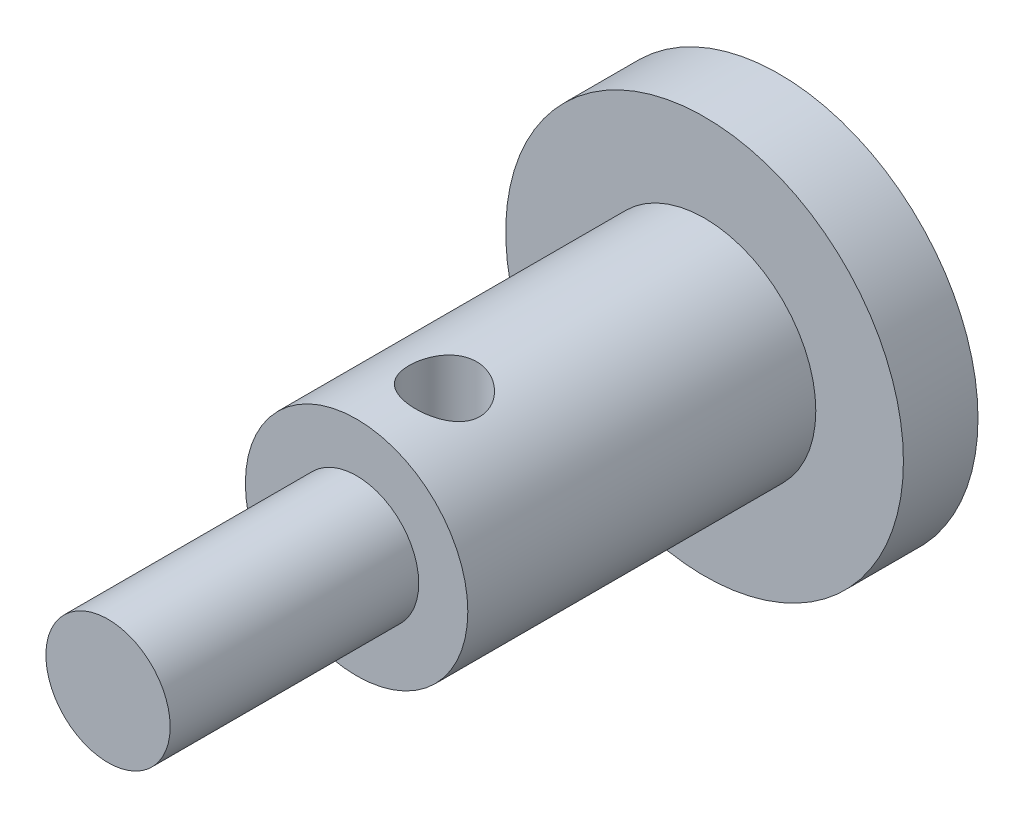
ISO-10303-21;
HEADER;
FILE_DESCRIPTION(('STEP AP214'),'2;1');
FILE_NAME('part.step','',(''),(''),'','','');
FILE_SCHEMA(('AUTOMOTIVE_DESIGN { 1 0 10303 214 1 1 1 1 }'));
ENDSEC;
DATA;
#1=APPLICATION_CONTEXT('core data for automotive mechanical design processes');
#2=APPLICATION_PROTOCOL_DEFINITION('international standard','automotive_design',2000,#1);
#3=PRODUCT_CONTEXT('',#1,'mechanical');
#4=PRODUCT('Part','Part','',(#3));
#5=PRODUCT_RELATED_PRODUCT_CATEGORY('part','',(#4));
#6=PRODUCT_DEFINITION_FORMATION('','',#4);
#7=PRODUCT_DEFINITION_CONTEXT('part definition',#1,'design');
#8=PRODUCT_DEFINITION('design','',#6,#7);
#9=PRODUCT_DEFINITION_SHAPE('','',#8);
#10=(LENGTH_UNIT() NAMED_UNIT(*) SI_UNIT(.MILLI.,.METRE.));
#11=(NAMED_UNIT(*) PLANE_ANGLE_UNIT() SI_UNIT($,.RADIAN.));
#12=(NAMED_UNIT(*) SI_UNIT($,.STERADIAN.) SOLID_ANGLE_UNIT());
#13=UNCERTAINTY_MEASURE_WITH_UNIT(LENGTH_MEASURE(1.E-05),#10,'distance_accuracy_value','');
#14=(GEOMETRIC_REPRESENTATION_CONTEXT(3) GLOBAL_UNCERTAINTY_ASSIGNED_CONTEXT((#13)) GLOBAL_UNIT_ASSIGNED_CONTEXT((#10,
#11,#12)) REPRESENTATION_CONTEXT('',''));
#15=CARTESIAN_POINT('',(0.,0.,0.));
#16=DIRECTION('',(0.,0.,1.));
#17=DIRECTION('',(1.,0.,0.));
#18=AXIS2_PLACEMENT_3D('',#15,#16,#17);
#19=CARTESIAN_POINT('',(0.,0.,17.));
#20=DIRECTION('',(0.,0.,1.));
#21=DIRECTION('',(1.,0.,0.));
#22=AXIS2_PLACEMENT_3D('',#19,#20,#21);
#23=PLANE('',#22);
#24=CARTESIAN_POINT('',(0.,0.,17.));
#25=DIRECTION('',(0.,0.,1.));
#26=DIRECTION('',(1.,0.,0.));
#27=AXIS2_PLACEMENT_3D('',#24,#25,#26);
#28=CIRCLE('',#27,4.475);
#29=CARTESIAN_POINT('',(4.475,0.,17.));
#30=VERTEX_POINT('',#29);
#31=EDGE_CURVE('E47',#30,#30,#28,.T.);
#32=ORIENTED_EDGE('',*,*,#31,.T.);
#33=EDGE_LOOP('',(#32));
#34=FACE_BOUND('',#33,.T.);
#35=CARTESIAN_POINT('',(0.,0.,17.));
#36=DIRECTION('',(0.,0.,1.));
#37=DIRECTION('',(1.,0.,0.));
#38=AXIS2_PLACEMENT_3D('',#35,#36,#37);
#39=CIRCLE('',#38,2.5);
#40=CARTESIAN_POINT('',(2.5,0.,17.));
#41=VERTEX_POINT('',#40);
#42=EDGE_CURVE('E84',#41,#41,#39,.T.);
#43=ORIENTED_EDGE('',*,*,#42,.F.);
#44=EDGE_LOOP('',(#43));
#45=FACE_BOUND('',#44,.T.);
#46=ADVANCED_FACE('F30',(#34,#45),#23,.T.);
#47=CARTESIAN_POINT('',(0.,0.,3.));
#48=DIRECTION('',(0.,0.,1.));
#49=DIRECTION('',(1.,0.,0.));
#50=AXIS2_PLACEMENT_3D('',#47,#48,#49);
#51=PLANE('',#50);
#52=CARTESIAN_POINT('',(0.,0.,3.));
#53=DIRECTION('',(0.,0.,1.));
#54=DIRECTION('',(1.,0.,0.));
#55=AXIS2_PLACEMENT_3D('',#52,#53,#54);
#56=CIRCLE('',#55,8.);
#57=CARTESIAN_POINT('',(8.,0.,3.));
#58=VERTEX_POINT('',#57);
#59=EDGE_CURVE('E10',#58,#58,#56,.T.);
#60=ORIENTED_EDGE('',*,*,#59,.T.);
#61=EDGE_LOOP('',(#60));
#62=FACE_BOUND('',#61,.T.);
#63=CARTESIAN_POINT('',(0.,0.,3.));
#64=DIRECTION('',(0.,0.,1.));
#65=DIRECTION('',(1.,0.,0.));
#66=AXIS2_PLACEMENT_3D('',#63,#64,#65);
#67=CIRCLE('',#66,4.475);
#68=CARTESIAN_POINT('',(4.475,0.,3.));
#69=VERTEX_POINT('',#68);
#70=EDGE_CURVE('E50',#69,#69,#67,.T.);
#71=ORIENTED_EDGE('',*,*,#70,.F.);
#72=EDGE_LOOP('',(#71));
#73=FACE_BOUND('',#72,.T.);
#74=ADVANCED_FACE('F74',(#62,#73),#51,.T.);
#75=CARTESIAN_POINT('',(0.,0.,3.));
#76=DIRECTION('',(0.,0.,-1.));
#77=DIRECTION('',(-1.,0.,0.));
#78=AXIS2_PLACEMENT_3D('',#75,#76,#77);
#79=CYLINDRICAL_SURFACE('',#78,8.);
#80=ORIENTED_EDGE('',*,*,#59,.F.);
#81=EDGE_LOOP('',(#80));
#82=FACE_BOUND('',#81,.T.);
#83=CARTESIAN_POINT('',(0.,0.,0.));
#84=DIRECTION('',(0.,0.,1.));
#85=DIRECTION('',(1.,0.,0.));
#86=AXIS2_PLACEMENT_3D('',#83,#84,#85);
#87=CIRCLE('',#86,8.);
#88=CARTESIAN_POINT('',(8.,0.,0.));
#89=VERTEX_POINT('',#88);
#90=EDGE_CURVE('E42',#89,#89,#87,.T.);
#91=ORIENTED_EDGE('',*,*,#90,.T.);
#92=EDGE_LOOP('',(#91));
#93=FACE_BOUND('',#92,.T.);
#94=ADVANCED_FACE('F32',(#82,#93),#79,.T.);
#95=CARTESIAN_POINT('',(0.,0.,0.));
#96=DIRECTION('',(0.,0.,1.));
#97=DIRECTION('',(1.,0.,0.));
#98=AXIS2_PLACEMENT_3D('',#95,#96,#97);
#99=PLANE('',#98);
#100=ORIENTED_EDGE('',*,*,#90,.F.);
#101=EDGE_LOOP('',(#100));
#102=FACE_BOUND('',#101,.T.);
#103=ADVANCED_FACE('F96',(#102),#99,.F.);
#104=CARTESIAN_POINT('',(0.,0.,17.));
#105=DIRECTION('',(0.,0.,-1.));
#106=DIRECTION('',(-1.,0.,0.));
#107=AXIS2_PLACEMENT_3D('',#104,#105,#106);
#108=CYLINDRICAL_SURFACE('',#107,4.475);
#109=CARTESIAN_POINT('',(0.525,-4.44409720865779,15.4151527868712));
#110=CARTESIAN_POINT('',(0.605012065182564,-4.43464369556174,15.4151512445683));
#111=CARTESIAN_POINT('',(0.684780562824033,-4.42300882738794,15.4083905448992));
#112=CARTESIAN_POINT('',(0.841456441181997,-4.3958970357306,15.3818435556699));
#113=CARTESIAN_POINT('',(0.918362178822913,-4.38041794379825,15.362049904044));
#114=CARTESIAN_POINT('',(1.06706900065759,-4.34658400698397,15.3103679521133));
#115=CARTESIAN_POINT('',(1.13888261209456,-4.32823660248138,15.2785106489329));
#116=CARTESIAN_POINT('',(1.27597831846422,-4.28982273173913,15.2037251079734));
#117=CARTESIAN_POINT('',(1.34125941804507,-4.26975600439011,15.1607951866255));
#118=CARTESIAN_POINT('',(1.46659270250455,-4.22838936108524,15.0628265855569));
#119=CARTESIAN_POINT('',(1.52628942871232,-4.2070739857202,15.0073389910547));
#120=CARTESIAN_POINT('',(1.63559780198055,-4.16579703592693,14.8867148224825));
#121=CARTESIAN_POINT('',(1.68520695969933,-4.14583579647105,14.8215758735558));
#122=CARTESIAN_POINT('',(1.77330661965326,-4.10893156378564,14.6823972932089));
#123=CARTESIAN_POINT('',(1.81168184822287,-4.09202050260056,14.6082757175539));
#124=CARTESIAN_POINT('',(1.87510942559609,-4.06335012686617,14.4536174850738));
#125=CARTESIAN_POINT('',(1.90017229890545,-4.05158674395603,14.3730859539383));
#126=CARTESIAN_POINT('',(1.93434949375536,-4.03537465048781,14.2146583434211));
#127=CARTESIAN_POINT('',(1.94455986570693,-4.03042489483808,14.1370504157553));
#128=CARTESIAN_POINT('',(1.95210568539031,-4.02677670241697,13.9810784002129));
#129=CARTESIAN_POINT('',(1.94944676893413,-4.02807552921959,13.9027146583306));
#130=CARTESIAN_POINT('',(1.93205315913773,-4.03644307005809,13.7533416519209));
#131=CARTESIAN_POINT('',(1.91818766880572,-4.04309633051778,13.6822047734311));
#132=CARTESIAN_POINT('',(1.8800662687396,-4.06096234609981,13.5433821139513));
#133=CARTESIAN_POINT('',(1.85580852753211,-4.07217590488648,13.4756969436254));
#134=CARTESIAN_POINT('',(1.79677877846324,-4.09857110642983,13.3431246010191));
#135=CARTESIAN_POINT('',(1.76168249083852,-4.11387283323108,13.2784065239222));
#136=CARTESIAN_POINT('',(1.68233433719151,-4.1469532808019,13.1555538648981));
#137=CARTESIAN_POINT('',(1.63807886603702,-4.16473297601815,13.0974218893003));
#138=CARTESIAN_POINT('',(1.53703367223395,-4.20313302816671,12.9838206898946));
#139=CARTESIAN_POINT('',(1.47946931963451,-4.22386460793297,12.9290766259361));
#140=CARTESIAN_POINT('',(1.35600367204305,-4.26510428781182,12.8298360969334));
#141=CARTESIAN_POINT('',(1.29009959497533,-4.28561231085627,12.7853430656));
#142=CARTESIAN_POINT('',(1.14841607934971,-4.32578421740276,12.7060801193193));
#143=CARTESIAN_POINT('',(1.07233377844367,-4.34537383493074,12.6718108186845));
#144=CARTESIAN_POINT('',(0.91466246132093,-4.38127190957764,12.6169268011243));
#145=CARTESIAN_POINT('',(0.8330751347605,-4.39758136741227,12.5963079152983));
#146=CARTESIAN_POINT('',(0.670142351244457,-4.4252780694317,12.5702625262009));
#147=CARTESIAN_POINT('',(0.588918715901119,-4.43683665619245,12.5642592609818));
#148=CARTESIAN_POINT('',(0.426131674204313,-4.45541686644188,12.5662606139193));
#149=CARTESIAN_POINT('',(0.344568399377873,-4.46244010675176,12.5742602363606));
#150=CARTESIAN_POINT('',(0.188163186510881,-4.47169191923213,12.6033764791664));
#151=CARTESIAN_POINT('',(0.113197008558179,-4.47416058517768,12.6237556940672));
#152=CARTESIAN_POINT('',(-0.0324528816684802,-4.47547518325439,12.6764299098869));
#153=CARTESIAN_POINT('',(-0.103136656087699,-4.47432116796992,12.7087247378409));
#154=CARTESIAN_POINT('',(-0.237946438962588,-4.46917715997548,12.7841347734468));
#155=CARTESIAN_POINT('',(-0.302099189312989,-4.46519931179385,12.8272031351925));
#156=CARTESIAN_POINT('',(-0.422536586260892,-4.4554174267679,12.92304237999));
#157=CARTESIAN_POINT('',(-0.478819872719763,-4.44961307479733,12.9758149366506));
#158=CARTESIAN_POINT('',(-0.583719501476302,-4.43709120913845,13.0914608347357));
#159=CARTESIAN_POINT('',(-0.632043979966886,-4.43035096044559,13.1545966474472));
#160=CARTESIAN_POINT('',(-0.717561548233948,-4.4173077649887,13.2880505412357));
#161=CARTESIAN_POINT('',(-0.75475378375657,-4.41100485181293,13.3583691729449));
#162=CARTESIAN_POINT('',(-0.817391637650078,-4.39983274351559,13.5053100136301));
#163=CARTESIAN_POINT('',(-0.842671449145731,-4.39498410880699,13.5820046604291));
#164=CARTESIAN_POINT('',(-0.879940943503478,-4.38767531552168,13.7386642552317));
#165=CARTESIAN_POINT('',(-0.891932563629168,-4.38521480879022,13.8186287247702));
#166=CARTESIAN_POINT('',(-0.902148989132983,-4.38312433775067,13.978095815519));
#167=CARTESIAN_POINT('',(-0.900605219970952,-4.38344678946501,14.0575830336042));
#168=CARTESIAN_POINT('',(-0.884353673174332,-4.38675399341761,14.2151401767178));
#169=CARTESIAN_POINT('',(-0.869646072091619,-4.38973870994987,14.2932101207402));
#170=CARTESIAN_POINT('',(-0.827677104884753,-4.39784310345277,14.4451954680354));
#171=CARTESIAN_POINT('',(-0.800502305497801,-4.40294803579624,14.5191356384506));
#172=CARTESIAN_POINT('',(-0.734414486889016,-4.41445126583187,14.6614637230281));
#173=CARTESIAN_POINT('',(-0.695499895310412,-4.42084973673487,14.7298508918968));
#174=CARTESIAN_POINT('',(-0.606170163860191,-4.43398823480564,14.8604701958604));
#175=CARTESIAN_POINT('',(-0.555558712882236,-4.44073235769492,14.922567750032));
#176=CARTESIAN_POINT('',(-0.444591724881872,-4.45320935007348,15.0374810349549));
#177=CARTESIAN_POINT('',(-0.384235338369446,-4.45894213131037,15.0902959556771));
#178=CARTESIAN_POINT('',(-0.255171030487521,-4.46818839904842,15.1853105132368));
#179=CARTESIAN_POINT('',(-0.186433572750902,-4.47169374951065,15.227470898966));
#180=CARTESIAN_POINT('',(-0.0427820018485037,-4.47537058711884,15.2996184349974));
#181=CARTESIAN_POINT('',(0.0321286097148479,-4.47554395137414,15.3296124300391));
#182=CARTESIAN_POINT('',(0.176446301706826,-4.47203016182671,15.3736691539589));
#183=CARTESIAN_POINT('',(0.245412259707018,-4.46881068785192,15.3892274347096));
#184=CARTESIAN_POINT('',(0.384647781324508,-4.45898435598281,15.4099698416118));
#185=CARTESIAN_POINT('',(0.45491732355909,-4.45237755360364,15.4151541377764));
#186=CARTESIAN_POINT('',(0.525,-4.44409720865779,15.4151527868712));
#187=B_SPLINE_CURVE_WITH_KNOTS('',3,(#109,#110,#111,#112,#113,#114,#115,#116,#117,#118,#119,
#120,#121,#122,#123,#124,#125,#126,#127,#128,#129,#130,#131,#132,#133,#134,#135,#136,#137,#138,
#139,#140,#141,#142,#143,#144,#145,#146,#147,#148,#149,#150,#151,#152,#153,#154,#155,#156,#157,
#158,#159,#160,#161,#162,#163,#164,#165,#166,#167,#168,#169,#170,#171,#172,#173,#174,#175,#176,
#177,#178,#179,#180,#181,#182,#183,#184,#185,#186),.UNSPECIFIED.,.T.,.F.,(4,2,2,2,2,2,2,2,2,2,2,
2,2,2,2,2,2,2,2,2,2,2,2,2,2,2,2,2,2,2,2,2,2,2,2,2,2,2,4),(0.,0.241435538480886,0.48300757642669,
0.723963069629632,0.964955221238552,1.2165291033196,1.46816499195436,1.72229907840933,
1.97623195090714,2.21026209743579,2.44418976506293,2.66153826238855,2.87892507979045,
3.10357663109331,3.32831677589519,3.57353301459052,3.81883127248413,4.07468192990253,
4.33045441324419,4.57595714207765,4.82137230241577,5.0534339477086,5.28549222456877,
5.516558482099,5.74766462731042,5.98593714063129,6.2242279335622,6.46574404721317,
6.70722494599234,6.94458521012121,7.18194229084785,7.41767564666965,7.6534405892191,
7.89349391001154,8.13356816815226,8.37451436929985,8.61532482689989,8.82680200839869,
9.038275724095),.UNSPECIFIED.);
#188=CARTESIAN_POINT('',(0.525,-4.44409720865779,15.4151527868712));
#189=VERTEX_POINT('',#188);
#190=EDGE_CURVE('E34',#189,#189,#187,.T.);
#191=ORIENTED_EDGE('',*,*,#190,.T.);
#192=EDGE_LOOP('',(#191));
#193=FACE_BOUND('',#192,.T.);
#194=CARTESIAN_POINT('',(0.525,4.44409720865779,15.4151527868712));
#195=CARTESIAN_POINT('',(0.4484089438116,4.45314628375916,15.4151539761182));
#196=CARTESIAN_POINT('',(0.371588546602911,4.46019531380006,15.4089599778983));
#197=CARTESIAN_POINT('',(0.219703812158274,4.47025111107797,15.3841888728163));
#198=CARTESIAN_POINT('',(0.144639199126942,4.47325851741295,15.3656137244685));
#199=CARTESIAN_POINT('',(-0.00150420369231874,4.4755968489669,15.3165608067146));
#200=CARTESIAN_POINT('',(-0.0725848989073443,4.47492954714651,15.2860887838645));
#201=CARTESIAN_POINT('',(-0.208823203903987,4.47064530775926,15.2141081495521));
#202=CARTESIAN_POINT('',(-0.273979730453568,4.46702783195492,15.1725975251099));
#203=CARTESIAN_POINT('',(-0.397413156820333,4.45775408795062,15.0791189439879));
#204=CARTESIAN_POINT('',(-0.455594621082442,4.45207306977956,15.0270275773238));
#205=CARTESIAN_POINT('',(-0.562648137041209,4.43981546350374,14.9141124856238));
#206=CARTESIAN_POINT('',(-0.611518804341062,4.43323874246828,14.8532874643589));
#207=CARTESIAN_POINT('',(-0.699990036453813,4.42014742320553,14.7225685184227));
#208=CARTESIAN_POINT('',(-0.739276424328126,4.41364031366015,14.6524608169627));
#209=CARTESIAN_POINT('',(-0.805556958407714,4.40202697965144,14.506547312949));
#210=CARTESIAN_POINT('',(-0.832551612272461,4.39692069733617,14.4307417458729));
#211=CARTESIAN_POINT('',(-0.87338651872805,4.3889927483233,14.2757215616678));
#212=CARTESIAN_POINT('',(-0.887255376258175,4.38616611560267,14.1965147527732));
#213=CARTESIAN_POINT('',(-0.901487332855884,4.38326371467137,14.0368517460612));
#214=CARTESIAN_POINT('',(-0.901852114794212,4.38318760369216,13.9563957051725));
#215=CARTESIAN_POINT('',(-0.889187051533484,4.38577350000684,13.7980812774245));
#216=CARTESIAN_POINT('',(-0.876402205698239,4.38838542525599,13.7202022974159));
#217=CARTESIAN_POINT('',(-0.838213263979534,4.39583871826443,13.5677151590166));
#218=CARTESIAN_POINT('',(-0.812808258054486,4.40068024679889,13.4931072369246));
#219=CARTESIAN_POINT('',(-0.749931503108982,4.41183042878988,13.3487383316633));
#220=CARTESIAN_POINT('',(-0.712386618022447,4.4181479083514,13.2790099233597));
#221=CARTESIAN_POINT('',(-0.626304815389212,4.43116874586612,13.1467367945282));
#222=CARTESIAN_POINT('',(-0.57776638972345,4.43787215666807,13.0841930613863));
#223=CARTESIAN_POINT('',(-0.470014283417967,4.45058419586035,12.9669110817011));
#224=CARTESIAN_POINT('',(-0.410626632014863,4.45657840303222,12.9123308387573));
#225=CARTESIAN_POINT('',(-0.283390095110734,4.46647268875725,12.8138883001017));
#226=CARTESIAN_POINT('',(-0.215542093243678,4.47037298578167,12.7700248864937));
#227=CARTESIAN_POINT('',(-0.0742046195960434,4.47493571622686,12.6948125851794));
#228=CARTESIAN_POINT('',(-0.000795708446898376,4.47563777409362,12.663314990259));
#229=CARTESIAN_POINT('',(0.150182765970779,4.47311540799165,12.6130312033508));
#230=CARTESIAN_POINT('',(0.227751292071129,4.46989195850635,12.5942418584175));
#231=CARTESIAN_POINT('',(0.382195497902662,4.45930009622079,12.57024072635));
#232=CARTESIAN_POINT('',(0.459017934815782,4.45206346243434,12.5646255561113));
#233=CARTESIAN_POINT('',(0.612082456134641,4.4336128738122,12.5657581285715));
#234=CARTESIAN_POINT('',(0.688324530191816,4.42239884822377,12.5725060912037));
#235=CARTESIAN_POINT('',(0.838461508384319,4.39641198514033,12.5979640455786));
#236=CARTESIAN_POINT('',(0.912345833110855,4.38162512602196,12.6167216600789));
#237=CARTESIAN_POINT('',(1.0556665321384,4.34932140535742,12.6654821180611));
#238=CARTESIAN_POINT('',(1.12510181333986,4.33180387650596,12.6954877127839));
#239=CARTESIAN_POINT('',(1.26150537763774,4.29412327278907,12.7676772867135));
#240=CARTESIAN_POINT('',(1.32815518321793,4.27386979090218,12.8104156825743));
#241=CARTESIAN_POINT('',(1.45342417175318,4.23291081626248,12.906235115995));
#242=CARTESIAN_POINT('',(1.51203989041935,4.21220513295447,12.9593205914563));
#243=CARTESIAN_POINT('',(1.62240658091983,4.17097759908773,13.0773810446603));
#244=CARTESIAN_POINT('',(1.67371014240789,4.15050931745063,13.1427949219208));
#245=CARTESIAN_POINT('',(1.76449556935567,4.11273710754704,13.2822057040312));
#246=CARTESIAN_POINT('',(1.80397997075203,4.09543250078834,13.3562007629559));
#247=CARTESIAN_POINT('',(1.86848880450689,4.06639780887166,13.5082347951616));
#248=CARTESIAN_POINT('',(1.89395920405349,4.0544982044843,13.5860507584856));
#249=CARTESIAN_POINT('',(1.93122968288839,4.03688177404234,13.745543273431));
#250=CARTESIAN_POINT('',(1.9430415812581,4.03115960276801,13.8272164235164));
#251=CARTESIAN_POINT('',(1.95194411564226,4.02685428682675,13.983935135889));
#252=CARTESIAN_POINT('',(1.95029555567105,4.02765966841237,14.0588948307573));
#253=CARTESIAN_POINT('',(1.93532350369099,4.03487495325737,14.2073557557506));
#254=CARTESIAN_POINT('',(1.92200054579306,4.04128460011813,14.2808570524409));
#255=CARTESIAN_POINT('',(1.88478148435346,4.05877165345963,14.4223983334104));
#256=CARTESIAN_POINT('',(1.8611754249181,4.06972064129147,14.4905314954013));
#257=CARTESIAN_POINT('',(1.80431347489905,4.09524666573486,14.6219038487115));
#258=CARTESIAN_POINT('',(1.77105497144611,4.1098246845551,14.6851417090176));
#259=CARTESIAN_POINT('',(1.6930860406279,4.14258315473325,14.8099080459435));
#260=CARTESIAN_POINT('',(1.64771780455809,4.16094868559255,14.8709763117868));
#261=CARTESIAN_POINT('',(1.5481190117966,4.19902302741101,14.9849316617056));
#262=CARTESIAN_POINT('',(1.49388442693008,4.21873244654419,15.0378150058346));
#263=CARTESIAN_POINT('',(1.37303459513969,4.25966943281457,15.1382459314064));
#264=CARTESIAN_POINT('',(1.30577464892914,4.2808917105148,15.1850231431764));
#265=CARTESIAN_POINT('',(1.16384046845255,4.32163705558112,15.2665559723996));
#266=CARTESIAN_POINT('',(1.08916586161412,4.34116003746828,15.3013109853666));
#267=CARTESIAN_POINT('',(0.934546560402471,4.37704437404545,15.3574986918908));
#268=CARTESIAN_POINT('',(0.854622109558477,4.39341701525469,15.3789795777834));
#269=CARTESIAN_POINT('',(0.691554614581172,4.42201476954973,15.4078021971939));
#270=CARTESIAN_POINT('',(0.608413315899727,4.43424209766189,15.4151514916934));
#271=CARTESIAN_POINT('',(0.525,4.44409720865779,15.4151527868712));
#272=B_SPLINE_CURVE_WITH_KNOTS('',3,(#194,#195,#196,#197,#198,#199,#200,#201,#202,#203,#204,
#205,#206,#207,#208,#209,#210,#211,#212,#213,#214,#215,#216,#217,#218,#219,#220,#221,#222,#223,
#224,#225,#226,#227,#228,#229,#230,#231,#232,#233,#234,#235,#236,#237,#238,#239,#240,#241,#242,
#243,#244,#245,#246,#247,#248,#249,#250,#251,#252,#253,#254,#255,#256,#257,#258,#259,#260,#261,
#262,#263,#264,#265,#266,#267,#268,#269,#270,#271),.UNSPECIFIED.,.T.,.F.,(4,2,2,2,2,2,2,2,2,2,2,
2,2,2,2,2,2,2,2,2,2,2,2,2,2,2,2,2,2,2,2,2,2,2,2,2,2,2,4),(0.,0.231078875270626,0.4621212059661,
0.693052073916291,0.924025082926815,1.15786513987705,1.39173993877396,1.63247898494765,
1.87320808748403,2.11341135479492,2.35358468800113,2.58936285191954,2.82515802030437,
3.06240105170325,3.29967664837777,3.54115799366858,3.78261413874169,4.02107048940486,
4.2594676567869,4.49046422891549,4.72146491038607,4.95338731735174,5.1853664892827,
5.4294669119266,5.67367226146373,5.92926204878656,6.18479695700942,6.43164428145569,
6.67827784181176,6.90209479158685,7.12590150213298,7.34376742017066,7.56169236853805,
7.79549456791455,8.02940328541859,8.28211028443223,8.53482998791691,8.78662670574347,
9.0382886644621),.UNSPECIFIED.);
#273=CARTESIAN_POINT('',(0.525,4.44409720865779,15.4151527868712));
#274=VERTEX_POINT('',#273);
#275=EDGE_CURVE('E52',#274,#274,#272,.T.);
#276=ORIENTED_EDGE('',*,*,#275,.T.);
#277=EDGE_LOOP('',(#276));
#278=FACE_BOUND('',#277,.T.);
#279=ORIENTED_EDGE('',*,*,#31,.F.);
#280=EDGE_LOOP('',(#279));
#281=FACE_BOUND('',#280,.T.);
#282=ORIENTED_EDGE('',*,*,#70,.T.);
#283=EDGE_LOOP('',(#282));
#284=FACE_BOUND('',#283,.T.);
#285=ADVANCED_FACE('F56',(#193,#278,#281,#284),#108,.T.);
#286=CARTESIAN_POINT('',(0.,0.,27.));
#287=DIRECTION('',(0.,0.,-1.));
#288=DIRECTION('',(-1.,0.,0.));
#289=AXIS2_PLACEMENT_3D('',#286,#287,#288);
#290=CYLINDRICAL_SURFACE('',#289,2.5);
#291=CARTESIAN_POINT('',(0.,0.,27.));
#292=DIRECTION('',(0.,0.,1.));
#293=DIRECTION('',(1.,0.,0.));
#294=AXIS2_PLACEMENT_3D('',#291,#292,#293);
#295=CIRCLE('',#294,2.5);
#296=CARTESIAN_POINT('',(2.5,0.,27.));
#297=VERTEX_POINT('',#296);
#298=EDGE_CURVE('E86',#297,#297,#295,.T.);
#299=ORIENTED_EDGE('',*,*,#298,.F.);
#300=EDGE_LOOP('',(#299));
#301=FACE_BOUND('',#300,.T.);
#302=ORIENTED_EDGE('',*,*,#42,.T.);
#303=EDGE_LOOP('',(#302));
#304=FACE_BOUND('',#303,.T.);
#305=ADVANCED_FACE('F69',(#301,#304),#290,.T.);
#306=CARTESIAN_POINT('',(0.,0.,27.));
#307=DIRECTION('',(0.,0.,1.));
#308=DIRECTION('',(1.,0.,0.));
#309=AXIS2_PLACEMENT_3D('',#306,#307,#308);
#310=PLANE('',#309);
#311=ORIENTED_EDGE('',*,*,#298,.T.);
#312=EDGE_LOOP('',(#311));
#313=FACE_BOUND('',#312,.T.);
#314=ADVANCED_FACE('F64',(#313),#310,.T.);
#315=CARTESIAN_POINT('',(0.525,-7.5,13.9901527868712));
#316=DIRECTION('',(0.,1.,0.));
#317=DIRECTION('',(0.,0.,1.));
#318=AXIS2_PLACEMENT_3D('',#315,#316,#317);
#319=CYLINDRICAL_SURFACE('',#318,1.425);
#320=ORIENTED_EDGE('',*,*,#275,.F.);
#321=EDGE_LOOP('',(#320));
#322=FACE_BOUND('',#321,.T.);
#323=ORIENTED_EDGE('',*,*,#190,.F.);
#324=EDGE_LOOP('',(#323));
#325=FACE_BOUND('',#324,.T.);
#326=ADVANCED_FACE('F60',(#322,#325),#319,.F.);
#327=CLOSED_SHELL('',(#46,#74,#94,#103,#285,#305,#314,#326));
#328=MANIFOLD_SOLID_BREP('B2',#327);
#329=ADVANCED_BREP_SHAPE_REPRESENTATION('',(#18,#328),#14);
#330=SHAPE_DEFINITION_REPRESENTATION(#9,#329);
ENDSEC;
END-ISO-10303-21;
